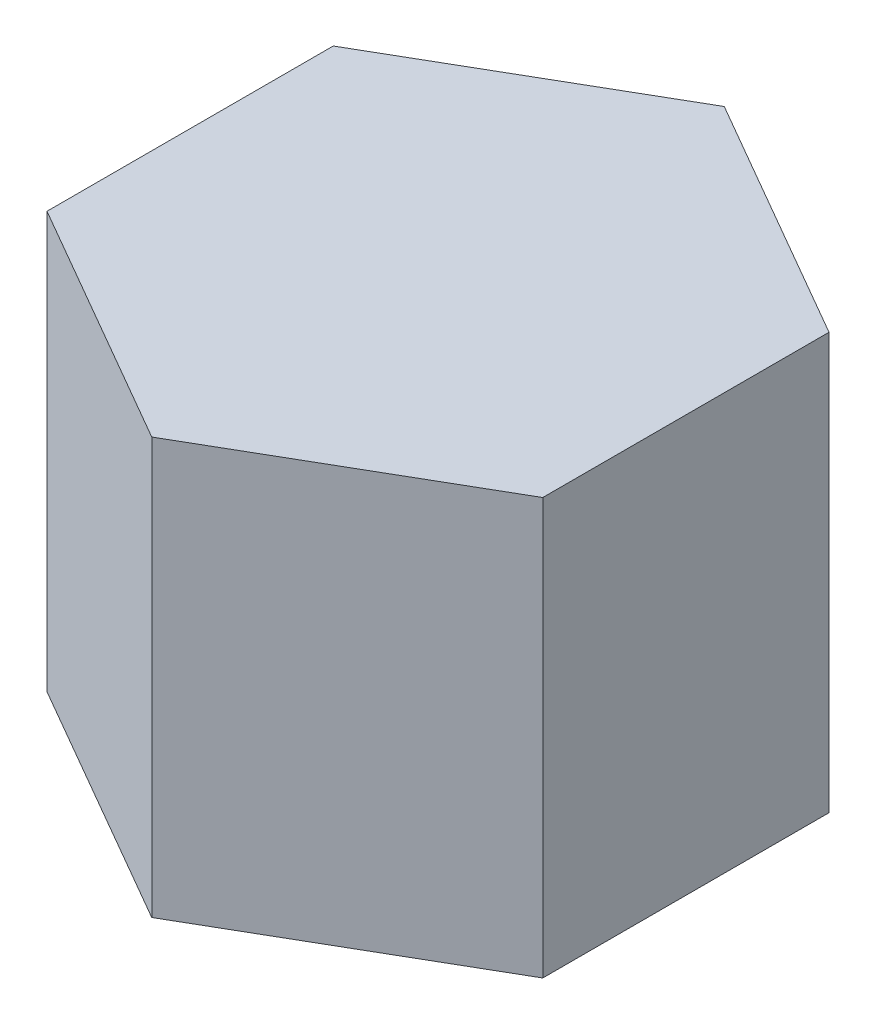
ISO-10303-21;
HEADER;
FILE_DESCRIPTION(('STEP AP214'),'2;1');
FILE_NAME('part.step','',(''),(''),'','','');
FILE_SCHEMA(('AUTOMOTIVE_DESIGN { 1 0 10303 214 1 1 1 1 }'));
ENDSEC;
DATA;
#1=APPLICATION_CONTEXT('core data for automotive mechanical design processes');
#2=APPLICATION_PROTOCOL_DEFINITION('international standard','automotive_design',2000,#1);
#3=PRODUCT_CONTEXT('',#1,'mechanical');
#4=PRODUCT('Part','Part','',(#3));
#5=PRODUCT_RELATED_PRODUCT_CATEGORY('part','',(#4));
#6=PRODUCT_DEFINITION_FORMATION('','',#4);
#7=PRODUCT_DEFINITION_CONTEXT('part definition',#1,'design');
#8=PRODUCT_DEFINITION('design','',#6,#7);
#9=PRODUCT_DEFINITION_SHAPE('','',#8);
#10=(LENGTH_UNIT() NAMED_UNIT(*) SI_UNIT(.MILLI.,.METRE.));
#11=(NAMED_UNIT(*) PLANE_ANGLE_UNIT() SI_UNIT($,.RADIAN.));
#12=(NAMED_UNIT(*) SI_UNIT($,.STERADIAN.) SOLID_ANGLE_UNIT());
#13=UNCERTAINTY_MEASURE_WITH_UNIT(LENGTH_MEASURE(1.E-05),#10,'distance_accuracy_value','');
#14=(GEOMETRIC_REPRESENTATION_CONTEXT(3) GLOBAL_UNCERTAINTY_ASSIGNED_CONTEXT((#13)) GLOBAL_UNIT_ASSIGNED_CONTEXT((#10,
#11,#12)) REPRESENTATION_CONTEXT('',''));
#15=CARTESIAN_POINT('',(0.,0.,0.));
#16=DIRECTION('',(0.,0.,1.));
#17=DIRECTION('',(1.,0.,0.));
#18=AXIS2_PLACEMENT_3D('',#15,#16,#17);
#19=CARTESIAN_POINT('',(202.339551417382,-147.556598747966,293.414022028063));
#20=DIRECTION('',(-0.500000000000096,0.,-0.866025403784383));
#21=DIRECTION('',(-0.866025403784383,0.,0.500000000000096));
#22=AXIS2_PLACEMENT_3D('',#19,#20,#21);
#23=PLANE('',#22);
#24=CARTESIAN_POINT('',(202.642660308706,-147.047793579175,293.239022028063));
#25=DIRECTION('',(-0.866025403784383,0.,0.500000000000096));
#26=VECTOR('',#25,1.);
#27=LINE('',#24,#26);
#28=CARTESIAN_POINT('',(202.642660308706,-147.047793579175,293.239022028063));
#29=VERTEX_POINT('',#28);
#30=CARTESIAN_POINT('',(202.339551417382,-147.047793579175,293.414022028063));
#31=VERTEX_POINT('',#30);
#32=EDGE_CURVE('E170',#29,#31,#27,.T.);
#33=ORIENTED_EDGE('',*,*,#32,.T.);
#34=CARTESIAN_POINT('',(202.339551417382,-147.556598747966,293.414022028063));
#35=DIRECTION('',(0.,1.,0.));
#36=VECTOR('',#35,1.);
#37=LINE('',#34,#36);
#38=CARTESIAN_POINT('',(202.339551417382,-147.556598747966,293.414022028063));
#39=VERTEX_POINT('',#38);
#40=EDGE_CURVE('E35',#39,#31,#37,.T.);
#41=ORIENTED_EDGE('',*,*,#40,.F.);
#42=CARTESIAN_POINT('',(202.642660308706,-147.556598747966,293.239022028063));
#43=DIRECTION('',(-0.866025403784383,0.,0.500000000000096));
#44=VECTOR('',#43,1.);
#45=LINE('',#42,#44);
#46=CARTESIAN_POINT('',(202.642660308706,-147.556598747966,293.239022028063));
#47=VERTEX_POINT('',#46);
#48=EDGE_CURVE('E159',#47,#39,#45,.T.);
#49=ORIENTED_EDGE('',*,*,#48,.F.);
#50=CARTESIAN_POINT('',(202.642660308706,-147.556598747966,293.239022028063));
#51=DIRECTION('',(0.,1.,0.));
#52=VECTOR('',#51,1.);
#53=LINE('',#50,#52);
#54=EDGE_CURVE('E10',#47,#29,#53,.T.);
#55=ORIENTED_EDGE('',*,*,#54,.T.);
#56=EDGE_LOOP('',(#33,#41,#49,#55));
#57=FACE_BOUND('',#56,.T.);
#58=ADVANCED_FACE('F16',(#57),#23,.F.);
#59=CARTESIAN_POINT('',(202.642660308706,-147.556598747966,291.594471220494));
#60=DIRECTION('',(-1.,0.,0.));
#61=DIRECTION('',(0.,-1.,0.));
#62=AXIS2_PLACEMENT_3D('',#59,#60,#61);
#63=PLANE('',#62);
#64=CARTESIAN_POINT('',(202.642660308706,-147.047793579175,292.889022028063));
#65=DIRECTION('',(0.,0.,1.));
#66=VECTOR('',#65,1.);
#67=LINE('',#64,#66);
#68=CARTESIAN_POINT('',(202.642660308706,-147.047793579175,292.889022028063));
#69=VERTEX_POINT('',#68);
#70=EDGE_CURVE('E167',#69,#29,#67,.T.);
#71=ORIENTED_EDGE('',*,*,#70,.T.);
#72=ORIENTED_EDGE('',*,*,#54,.F.);
#73=CARTESIAN_POINT('',(202.642660308706,-147.556598747966,292.889022028063));
#74=DIRECTION('',(0.,0.,1.));
#75=VECTOR('',#74,1.);
#76=LINE('',#73,#75);
#77=CARTESIAN_POINT('',(202.642660308706,-147.556598747966,292.889022028063));
#78=VERTEX_POINT('',#77);
#79=EDGE_CURVE('E156',#78,#47,#76,.T.);
#80=ORIENTED_EDGE('',*,*,#79,.F.);
#81=CARTESIAN_POINT('',(202.642660308706,-147.556598747966,292.889022028063));
#82=DIRECTION('',(0.,1.,0.));
#83=VECTOR('',#82,1.);
#84=LINE('',#81,#83);
#85=EDGE_CURVE('E27',#78,#69,#84,.T.);
#86=ORIENTED_EDGE('',*,*,#85,.T.);
#87=EDGE_LOOP('',(#71,#72,#80,#86));
#88=FACE_BOUND('',#87,.T.);
#89=ADVANCED_FACE('F189',(#88),#63,.F.);
#90=CARTESIAN_POINT('',(202.642660308706,-147.556598747966,292.889022028063));
#91=DIRECTION('',(-0.499999999999909,0.,0.866025403784491));
#92=DIRECTION('',(0.866025403784491,0.,0.499999999999909));
#93=AXIS2_PLACEMENT_3D('',#90,#91,#92);
#94=PLANE('',#93);
#95=CARTESIAN_POINT('',(202.339551417381,-147.047793579175,292.714022028063));
#96=DIRECTION('',(0.866025403784491,0.,0.499999999999909));
#97=VECTOR('',#96,1.);
#98=LINE('',#95,#97);
#99=CARTESIAN_POINT('',(202.339551417382,-147.047793579175,292.714022028063));
#100=VERTEX_POINT('',#99);
#101=EDGE_CURVE('E163',#100,#69,#98,.T.);
#102=ORIENTED_EDGE('',*,*,#101,.T.);
#103=ORIENTED_EDGE('',*,*,#85,.F.);
#104=CARTESIAN_POINT('',(202.339551417381,-147.556598747966,292.714022028063));
#105=DIRECTION('',(0.866025403784491,0.,0.499999999999909));
#106=VECTOR('',#105,1.);
#107=LINE('',#104,#106);
#108=CARTESIAN_POINT('',(202.339551417382,-147.556598747966,292.714022028063));
#109=VERTEX_POINT('',#108);
#110=EDGE_CURVE('E106',#109,#78,#107,.T.);
#111=ORIENTED_EDGE('',*,*,#110,.F.);
#112=CARTESIAN_POINT('',(202.339551417381,-147.556598747966,292.714022028063));
#113=DIRECTION('',(0.,1.,0.));
#114=VECTOR('',#113,1.);
#115=LINE('',#112,#114);
#116=EDGE_CURVE('E94',#109,#100,#115,.T.);
#117=ORIENTED_EDGE('',*,*,#116,.T.);
#118=EDGE_LOOP('',(#102,#103,#111,#117));
#119=FACE_BOUND('',#118,.T.);
#120=ADVANCED_FACE('F198',(#119),#94,.F.);
#121=CARTESIAN_POINT('',(202.339551417382,-147.556598747966,292.714022028063));
#122=DIRECTION('',(0.500000000000096,0.,0.866025403784383));
#123=DIRECTION('',(0.866025403784383,0.,-0.500000000000096));
#124=AXIS2_PLACEMENT_3D('',#121,#122,#123);
#125=PLANE('',#124);
#126=CARTESIAN_POINT('',(202.036442526057,-147.047793579175,292.889022028063));
#127=DIRECTION('',(0.866025403784383,0.,-0.500000000000096));
#128=VECTOR('',#127,1.);
#129=LINE('',#126,#128);
#130=CARTESIAN_POINT('',(202.036442526057,-147.047793579175,292.889022028063));
#131=VERTEX_POINT('',#130);
#132=EDGE_CURVE('E162',#131,#100,#129,.T.);
#133=ORIENTED_EDGE('',*,*,#132,.T.);
#134=ORIENTED_EDGE('',*,*,#116,.F.);
#135=CARTESIAN_POINT('',(202.036442526057,-147.556598747966,292.889022028063));
#136=DIRECTION('',(0.866025403784383,0.,-0.500000000000096));
#137=VECTOR('',#136,1.);
#138=LINE('',#135,#137);
#139=CARTESIAN_POINT('',(202.036442526057,-147.556598747966,292.889022028063));
#140=VERTEX_POINT('',#139);
#141=EDGE_CURVE('E98',#140,#109,#138,.T.);
#142=ORIENTED_EDGE('',*,*,#141,.F.);
#143=CARTESIAN_POINT('',(202.036442526057,-147.556598747966,292.889022028063));
#144=DIRECTION('',(0.,1.,0.));
#145=VECTOR('',#144,1.);
#146=LINE('',#143,#145);
#147=EDGE_CURVE('E79',#140,#131,#146,.T.);
#148=ORIENTED_EDGE('',*,*,#147,.T.);
#149=EDGE_LOOP('',(#133,#134,#142,#148));
#150=FACE_BOUND('',#149,.T.);
#151=ADVANCED_FACE('F100',(#150),#125,.F.);
#152=CARTESIAN_POINT('',(202.036442526057,-147.556598747966,291.594471220494));
#153=DIRECTION('',(1.,0.,0.));
#154=DIRECTION('',(0.,1.,0.));
#155=AXIS2_PLACEMENT_3D('',#152,#153,#154);
#156=PLANE('',#155);
#157=CARTESIAN_POINT('',(202.036442526057,-147.047793579175,293.239022028063));
#158=DIRECTION('',(0.,0.,-1.));
#159=VECTOR('',#158,1.);
#160=LINE('',#157,#159);
#161=CARTESIAN_POINT('',(202.036442526057,-147.047793579175,293.239022028063));
#162=VERTEX_POINT('',#161);
#163=EDGE_CURVE('E88',#162,#131,#160,.T.);
#164=ORIENTED_EDGE('',*,*,#163,.T.);
#165=ORIENTED_EDGE('',*,*,#147,.F.);
#166=CARTESIAN_POINT('',(202.036442526057,-147.556598747966,293.239022028063));
#167=DIRECTION('',(0.,0.,-1.));
#168=VECTOR('',#167,1.);
#169=LINE('',#166,#168);
#170=CARTESIAN_POINT('',(202.036442526057,-147.556598747966,293.239022028063));
#171=VERTEX_POINT('',#170);
#172=EDGE_CURVE('E84',#171,#140,#169,.T.);
#173=ORIENTED_EDGE('',*,*,#172,.F.);
#174=CARTESIAN_POINT('',(202.036442526057,-147.556598747966,293.239022028063));
#175=DIRECTION('',(0.,1.,0.));
#176=VECTOR('',#175,1.);
#177=LINE('',#174,#176);
#178=EDGE_CURVE('E58',#171,#162,#177,.T.);
#179=ORIENTED_EDGE('',*,*,#178,.T.);
#180=EDGE_LOOP('',(#164,#165,#173,#179));
#181=FACE_BOUND('',#180,.T.);
#182=ADVANCED_FACE('F82',(#181),#156,.F.);
#183=CARTESIAN_POINT('',(202.036442526057,-147.556598747966,293.239022028063));
#184=DIRECTION('',(0.499999999999978,0.,-0.866025403784452));
#185=DIRECTION('',(-0.866025403784452,0.,-0.499999999999978));
#186=AXIS2_PLACEMENT_3D('',#183,#184,#185);
#187=PLANE('',#186);
#188=CARTESIAN_POINT('',(202.339551417382,-147.047793579175,293.414022028063));
#189=DIRECTION('',(-0.866025403784452,0.,-0.499999999999978));
#190=VECTOR('',#189,1.);
#191=LINE('',#188,#190);
#192=EDGE_CURVE('E160',#31,#162,#191,.T.);
#193=ORIENTED_EDGE('',*,*,#192,.T.);
#194=ORIENTED_EDGE('',*,*,#178,.F.);
#195=CARTESIAN_POINT('',(202.339551417382,-147.556598747966,293.414022028063));
#196=DIRECTION('',(-0.866025403784452,0.,-0.499999999999978));
#197=VECTOR('',#196,1.);
#198=LINE('',#195,#197);
#199=EDGE_CURVE('E112',#39,#171,#198,.T.);
#200=ORIENTED_EDGE('',*,*,#199,.F.);
#201=ORIENTED_EDGE('',*,*,#40,.T.);
#202=EDGE_LOOP('',(#193,#194,#200,#201));
#203=FACE_BOUND('',#202,.T.);
#204=ADVANCED_FACE('F131',(#203),#187,.F.);
#205=CARTESIAN_POINT('',(206.491105863044,-147.556598747966,291.594471220494));
#206=DIRECTION('',(0.,1.,0.));
#207=DIRECTION('',(-1.,0.,0.));
#208=AXIS2_PLACEMENT_3D('',#205,#206,#207);
#209=PLANE('',#208);
#210=ORIENTED_EDGE('',*,*,#48,.T.);
#211=ORIENTED_EDGE('',*,*,#199,.T.);
#212=ORIENTED_EDGE('',*,*,#172,.T.);
#213=ORIENTED_EDGE('',*,*,#141,.T.);
#214=ORIENTED_EDGE('',*,*,#110,.T.);
#215=ORIENTED_EDGE('',*,*,#79,.T.);
#216=EDGE_LOOP('',(#210,#211,#212,#213,#214,#215));
#217=FACE_BOUND('',#216,.T.);
#218=ADVANCED_FACE('F111',(#217),#209,.F.);
#219=CARTESIAN_POINT('',(206.491105863044,-147.047793579175,291.594471220494));
#220=DIRECTION('',(0.,1.,0.));
#221=DIRECTION('',(-1.,0.,0.));
#222=AXIS2_PLACEMENT_3D('',#219,#220,#221);
#223=PLANE('',#222);
#224=ORIENTED_EDGE('',*,*,#32,.F.);
#225=ORIENTED_EDGE('',*,*,#70,.F.);
#226=ORIENTED_EDGE('',*,*,#101,.F.);
#227=ORIENTED_EDGE('',*,*,#132,.F.);
#228=ORIENTED_EDGE('',*,*,#163,.F.);
#229=ORIENTED_EDGE('',*,*,#192,.F.);
#230=EDGE_LOOP('',(#224,#225,#226,#227,#228,#229));
#231=FACE_BOUND('',#230,.T.);
#232=ADVANCED_FACE('F130',(#231),#223,.T.);
#233=CLOSED_SHELL('',(#58,#89,#120,#151,#182,#204,#218,#232));
#234=MANIFOLD_SOLID_BREP('B1',#233);
#235=ADVANCED_BREP_SHAPE_REPRESENTATION('',(#18,#234),#14);
#236=SHAPE_DEFINITION_REPRESENTATION(#9,#235);
ENDSEC;
END-ISO-10303-21;
